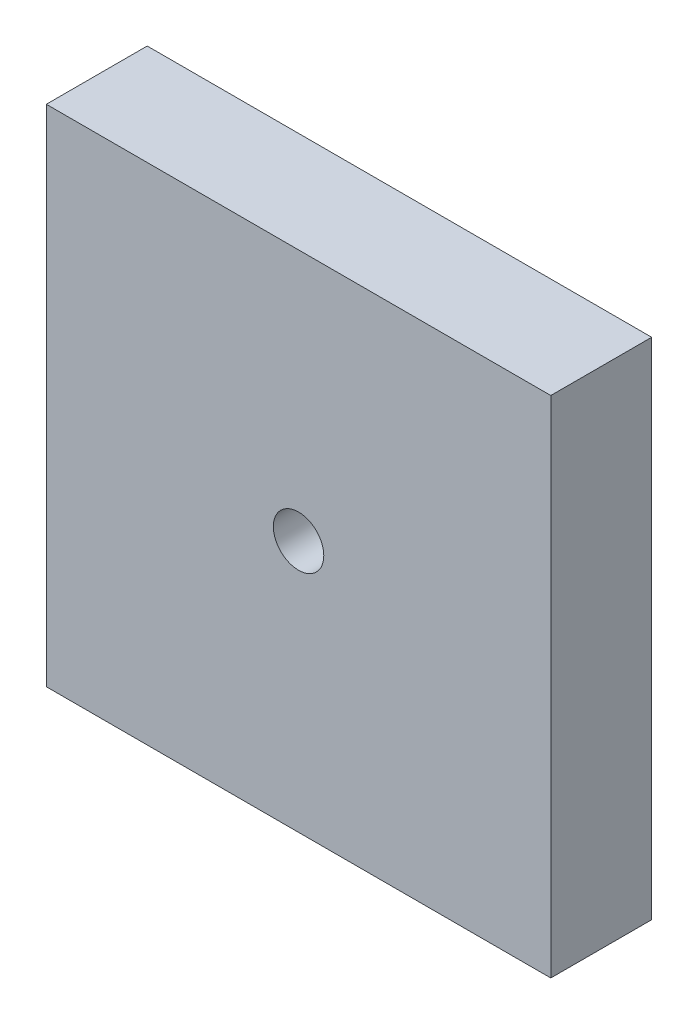
ISO-10303-21;
HEADER;
FILE_DESCRIPTION(('STEP AP214'),'2;1');
FILE_NAME('part.step','',(''),(''),'','','');
FILE_SCHEMA(('AUTOMOTIVE_DESIGN { 1 0 10303 214 1 1 1 1 }'));
ENDSEC;
DATA;
#1=APPLICATION_CONTEXT('core data for automotive mechanical design processes');
#2=APPLICATION_PROTOCOL_DEFINITION('international standard','automotive_design',2000,#1);
#3=PRODUCT_CONTEXT('',#1,'mechanical');
#4=PRODUCT('Part','Part','',(#3));
#5=PRODUCT_RELATED_PRODUCT_CATEGORY('part','',(#4));
#6=PRODUCT_DEFINITION_FORMATION('','',#4);
#7=PRODUCT_DEFINITION_CONTEXT('part definition',#1,'design');
#8=PRODUCT_DEFINITION('design','',#6,#7);
#9=PRODUCT_DEFINITION_SHAPE('','',#8);
#10=(LENGTH_UNIT() NAMED_UNIT(*) SI_UNIT(.MILLI.,.METRE.));
#11=(NAMED_UNIT(*) PLANE_ANGLE_UNIT() SI_UNIT($,.RADIAN.));
#12=(NAMED_UNIT(*) SI_UNIT($,.STERADIAN.) SOLID_ANGLE_UNIT());
#13=UNCERTAINTY_MEASURE_WITH_UNIT(LENGTH_MEASURE(1.E-05),#10,'distance_accuracy_value','');
#14=(GEOMETRIC_REPRESENTATION_CONTEXT(3) GLOBAL_UNCERTAINTY_ASSIGNED_CONTEXT((#13)) GLOBAL_UNIT_ASSIGNED_CONTEXT((#10,
#11,#12)) REPRESENTATION_CONTEXT('',''));
#15=CARTESIAN_POINT('',(0.,0.,0.));
#16=DIRECTION('',(0.,0.,1.));
#17=DIRECTION('',(1.,0.,0.));
#18=AXIS2_PLACEMENT_3D('',#15,#16,#17);
#19=CARTESIAN_POINT('',(0.,0.,2.));
#20=DIRECTION('',(0.,0.,-1.));
#21=DIRECTION('',(-1.,0.,0.));
#22=AXIS2_PLACEMENT_3D('',#19,#20,#21);
#23=PLANE('',#22);
#24=DIRECTION('',(0.,-1.,0.));
#25=VECTOR('',#24,1.);
#26=CARTESIAN_POINT('',(-5.,-5.,2.));
#27=LINE('',#26,#25);
#28=CARTESIAN_POINT('',(-5.,5.,2.));
#29=VERTEX_POINT('',#28);
#30=CARTESIAN_POINT('',(-5.,-5.,2.));
#31=VERTEX_POINT('',#30);
#32=EDGE_CURVE('E89',#29,#31,#27,.T.);
#33=ORIENTED_EDGE('',*,*,#32,.T.);
#34=DIRECTION('',(1.,0.,0.));
#35=VECTOR('',#34,1.);
#36=CARTESIAN_POINT('',(-5.,-5.,2.));
#37=LINE('',#36,#35);
#38=CARTESIAN_POINT('',(5.,-5.,2.));
#39=VERTEX_POINT('',#38);
#40=EDGE_CURVE('E84',#31,#39,#37,.T.);
#41=ORIENTED_EDGE('',*,*,#40,.T.);
#42=DIRECTION('',(0.,1.,0.));
#43=VECTOR('',#42,1.);
#44=CARTESIAN_POINT('',(5.,-5.,2.));
#45=LINE('',#44,#43);
#46=CARTESIAN_POINT('',(5.,5.,2.));
#47=VERTEX_POINT('',#46);
#48=EDGE_CURVE('E87',#39,#47,#45,.T.);
#49=ORIENTED_EDGE('',*,*,#48,.T.);
#50=DIRECTION('',(-1.,0.,0.));
#51=VECTOR('',#50,1.);
#52=CARTESIAN_POINT('',(-5.,5.,2.));
#53=LINE('',#52,#51);
#54=EDGE_CURVE('E54',#47,#29,#53,.T.);
#55=ORIENTED_EDGE('',*,*,#54,.T.);
#56=EDGE_LOOP('',(#33,#41,#49,#55));
#57=FACE_BOUND('',#56,.T.);
#58=CARTESIAN_POINT('',(0.,0.,2.));
#59=DIRECTION('',(0.,0.,1.));
#60=DIRECTION('',(1.,0.,0.));
#61=AXIS2_PLACEMENT_3D('',#58,#59,#60);
#62=CIRCLE('',#61,0.5);
#63=CARTESIAN_POINT('',(0.5,0.,2.));
#64=VERTEX_POINT('',#63);
#65=EDGE_CURVE('E104',#64,#64,#62,.T.);
#66=ORIENTED_EDGE('',*,*,#65,.F.);
#67=EDGE_LOOP('',(#66));
#68=FACE_BOUND('',#67,.T.);
#69=ADVANCED_FACE('F37',(#57,#68),#23,.F.);
#70=CARTESIAN_POINT('',(0.,0.,0.));
#71=DIRECTION('',(0.,0.,-1.));
#72=DIRECTION('',(-1.,0.,0.));
#73=AXIS2_PLACEMENT_3D('',#70,#71,#72);
#74=PLANE('',#73);
#75=DIRECTION('',(0.,-1.,0.));
#76=VECTOR('',#75,1.);
#77=CARTESIAN_POINT('',(-5.,-5.,0.));
#78=LINE('',#77,#76);
#79=CARTESIAN_POINT('',(-5.,5.,0.));
#80=VERTEX_POINT('',#79);
#81=CARTESIAN_POINT('',(-5.,-5.,0.));
#82=VERTEX_POINT('',#81);
#83=EDGE_CURVE('E101',#80,#82,#78,.T.);
#84=ORIENTED_EDGE('',*,*,#83,.F.);
#85=DIRECTION('',(-1.,0.,0.));
#86=VECTOR('',#85,1.);
#87=CARTESIAN_POINT('',(-5.,5.,0.));
#88=LINE('',#87,#86);
#89=CARTESIAN_POINT('',(5.,5.,0.));
#90=VERTEX_POINT('',#89);
#91=EDGE_CURVE('E77',#90,#80,#88,.T.);
#92=ORIENTED_EDGE('',*,*,#91,.F.);
#93=DIRECTION('',(0.,1.,0.));
#94=VECTOR('',#93,1.);
#95=CARTESIAN_POINT('',(5.,-5.,0.));
#96=LINE('',#95,#94);
#97=CARTESIAN_POINT('',(5.,-5.,0.));
#98=VERTEX_POINT('',#97);
#99=EDGE_CURVE('E71',#98,#90,#96,.T.);
#100=ORIENTED_EDGE('',*,*,#99,.F.);
#101=DIRECTION('',(1.,0.,0.));
#102=VECTOR('',#101,1.);
#103=CARTESIAN_POINT('',(-5.,-5.,0.));
#104=LINE('',#103,#102);
#105=EDGE_CURVE('E93',#82,#98,#104,.T.);
#106=ORIENTED_EDGE('',*,*,#105,.F.);
#107=EDGE_LOOP('',(#84,#92,#100,#106));
#108=FACE_BOUND('',#107,.T.);
#109=CARTESIAN_POINT('',(0.,0.,0.));
#110=DIRECTION('',(0.,0.,1.));
#111=DIRECTION('',(1.,0.,0.));
#112=AXIS2_PLACEMENT_3D('',#109,#110,#111);
#113=CIRCLE('',#112,0.5);
#114=CARTESIAN_POINT('',(0.5,0.,0.));
#115=VERTEX_POINT('',#114);
#116=EDGE_CURVE('E116',#115,#115,#113,.T.);
#117=ORIENTED_EDGE('',*,*,#116,.T.);
#118=EDGE_LOOP('',(#117));
#119=FACE_BOUND('',#118,.T.);
#120=ADVANCED_FACE('F112',(#108,#119),#74,.T.);
#121=CARTESIAN_POINT('',(-5.,-5.,2.));
#122=DIRECTION('',(1.,0.,0.));
#123=DIRECTION('',(0.,0.,-1.));
#124=AXIS2_PLACEMENT_3D('',#121,#122,#123);
#125=PLANE('',#124);
#126=ORIENTED_EDGE('',*,*,#83,.T.);
#127=DIRECTION('',(0.,0.,-1.));
#128=VECTOR('',#127,1.);
#129=CARTESIAN_POINT('',(-5.,-5.,2.));
#130=LINE('',#129,#128);
#131=EDGE_CURVE('E11',#31,#82,#130,.T.);
#132=ORIENTED_EDGE('',*,*,#131,.F.);
#133=ORIENTED_EDGE('',*,*,#32,.F.);
#134=DIRECTION('',(0.,0.,-1.));
#135=VECTOR('',#134,1.);
#136=CARTESIAN_POINT('',(-5.,5.,2.));
#137=LINE('',#136,#135);
#138=EDGE_CURVE('E97',#29,#80,#137,.T.);
#139=ORIENTED_EDGE('',*,*,#138,.T.);
#140=EDGE_LOOP('',(#126,#132,#133,#139));
#141=FACE_BOUND('',#140,.T.);
#142=ADVANCED_FACE('F39',(#141),#125,.F.);
#143=CARTESIAN_POINT('',(-5.,-5.,2.));
#144=DIRECTION('',(0.,1.,0.));
#145=DIRECTION('',(-1.,0.,0.));
#146=AXIS2_PLACEMENT_3D('',#143,#144,#145);
#147=PLANE('',#146);
#148=ORIENTED_EDGE('',*,*,#105,.T.);
#149=DIRECTION('',(0.,0.,-1.));
#150=VECTOR('',#149,1.);
#151=CARTESIAN_POINT('',(5.,-5.,2.));
#152=LINE('',#151,#150);
#153=EDGE_CURVE('E46',#39,#98,#152,.T.);
#154=ORIENTED_EDGE('',*,*,#153,.F.);
#155=ORIENTED_EDGE('',*,*,#40,.F.);
#156=ORIENTED_EDGE('',*,*,#131,.T.);
#157=EDGE_LOOP('',(#148,#154,#155,#156));
#158=FACE_BOUND('',#157,.T.);
#159=ADVANCED_FACE('F92',(#158),#147,.F.);
#160=CARTESIAN_POINT('',(5.,-5.,2.));
#161=DIRECTION('',(-1.,0.,0.));
#162=DIRECTION('',(0.,0.,1.));
#163=AXIS2_PLACEMENT_3D('',#160,#161,#162);
#164=PLANE('',#163);
#165=ORIENTED_EDGE('',*,*,#99,.T.);
#166=DIRECTION('',(0.,0.,-1.));
#167=VECTOR('',#166,1.);
#168=CARTESIAN_POINT('',(5.,5.,2.));
#169=LINE('',#168,#167);
#170=EDGE_CURVE('E94',#47,#90,#169,.T.);
#171=ORIENTED_EDGE('',*,*,#170,.F.);
#172=ORIENTED_EDGE('',*,*,#48,.F.);
#173=ORIENTED_EDGE('',*,*,#153,.T.);
#174=EDGE_LOOP('',(#165,#171,#172,#173));
#175=FACE_BOUND('',#174,.T.);
#176=ADVANCED_FACE('F95',(#175),#164,.F.);
#177=CARTESIAN_POINT('',(-5.,5.,2.));
#178=DIRECTION('',(0.,-1.,0.));
#179=DIRECTION('',(0.,0.,-1.));
#180=AXIS2_PLACEMENT_3D('',#177,#178,#179);
#181=PLANE('',#180);
#182=ORIENTED_EDGE('',*,*,#91,.T.);
#183=ORIENTED_EDGE('',*,*,#138,.F.);
#184=ORIENTED_EDGE('',*,*,#54,.F.);
#185=ORIENTED_EDGE('',*,*,#170,.T.);
#186=EDGE_LOOP('',(#182,#183,#184,#185));
#187=FACE_BOUND('',#186,.T.);
#188=ADVANCED_FACE('F109',(#187),#181,.F.);
#189=CARTESIAN_POINT('',(0.,0.,2.));
#190=DIRECTION('',(0.,0.,-1.));
#191=DIRECTION('',(-1.,0.,0.));
#192=AXIS2_PLACEMENT_3D('',#189,#190,#191);
#193=CYLINDRICAL_SURFACE('',#192,0.5);
#194=ORIENTED_EDGE('',*,*,#65,.T.);
#195=EDGE_LOOP('',(#194));
#196=FACE_BOUND('',#195,.T.);
#197=ORIENTED_EDGE('',*,*,#116,.F.);
#198=EDGE_LOOP('',(#197));
#199=FACE_BOUND('',#198,.T.);
#200=ADVANCED_FACE('F122',(#196,#199),#193,.F.);
#201=CLOSED_SHELL('',(#69,#120,#142,#159,#176,#188,#200));
#202=MANIFOLD_SOLID_BREP('B2',#201);
#203=ADVANCED_BREP_SHAPE_REPRESENTATION('',(#18,#202),#14);
#204=SHAPE_DEFINITION_REPRESENTATION(#9,#203);
ENDSEC;
END-ISO-10303-21;
